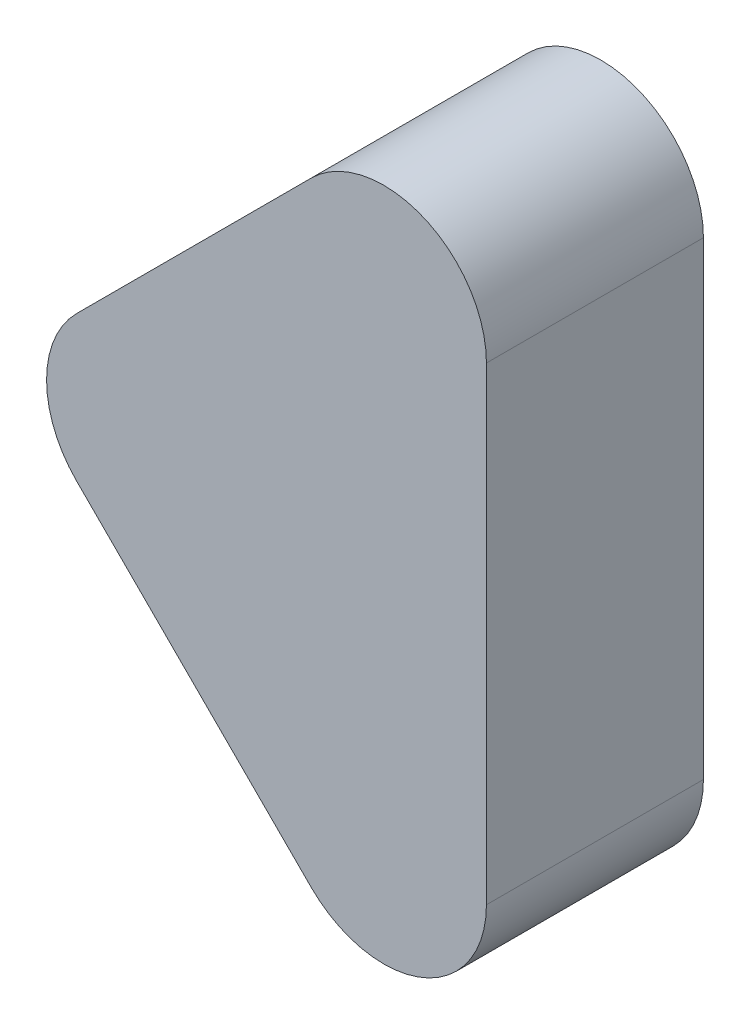
ISO-10303-21;
HEADER;
FILE_DESCRIPTION(('STEP AP214'),'2;1');
FILE_NAME('part.step','',(''),(''),'','','');
FILE_SCHEMA(('AUTOMOTIVE_DESIGN { 1 0 10303 214 1 1 1 1 }'));
ENDSEC;
DATA;
#1=APPLICATION_CONTEXT('core data for automotive mechanical design processes');
#2=APPLICATION_PROTOCOL_DEFINITION('international standard','automotive_design',2000,#1);
#3=PRODUCT_CONTEXT('',#1,'mechanical');
#4=PRODUCT('Part','Part','',(#3));
#5=PRODUCT_RELATED_PRODUCT_CATEGORY('part','',(#4));
#6=PRODUCT_DEFINITION_FORMATION('','',#4);
#7=PRODUCT_DEFINITION_CONTEXT('part definition',#1,'design');
#8=PRODUCT_DEFINITION('design','',#6,#7);
#9=PRODUCT_DEFINITION_SHAPE('','',#8);
#10=(LENGTH_UNIT() NAMED_UNIT(*) SI_UNIT(.MILLI.,.METRE.));
#11=(NAMED_UNIT(*) PLANE_ANGLE_UNIT() SI_UNIT($,.RADIAN.));
#12=(NAMED_UNIT(*) SI_UNIT($,.STERADIAN.) SOLID_ANGLE_UNIT());
#13=UNCERTAINTY_MEASURE_WITH_UNIT(LENGTH_MEASURE(1.E-05),#10,'distance_accuracy_value','');
#14=(GEOMETRIC_REPRESENTATION_CONTEXT(3) GLOBAL_UNCERTAINTY_ASSIGNED_CONTEXT((#13)) GLOBAL_UNIT_ASSIGNED_CONTEXT((#10,
#11,#12)) REPRESENTATION_CONTEXT('',''));
#15=CARTESIAN_POINT('',(0.,0.,0.));
#16=DIRECTION('',(0.,0.,1.));
#17=DIRECTION('',(1.,0.,0.));
#18=AXIS2_PLACEMENT_3D('',#15,#16,#17);
#19=CARTESIAN_POINT('',(8.00000000000002,-11.725,3.7));
#20=DIRECTION('',(0.,0.,-1.));
#21=DIRECTION('',(-1.,0.,0.));
#22=AXIS2_PLACEMENT_3D('',#19,#20,#21);
#23=CYLINDRICAL_SURFACE('',#22,1.75);
#24=CARTESIAN_POINT('',(8.00000000000002,-11.725,0.));
#25=DIRECTION('',(0.,0.,1.));
#26=DIRECTION('',(1.,0.,0.));
#27=AXIS2_PLACEMENT_3D('',#24,#25,#26);
#28=CIRCLE('',#27,1.75);
#29=CARTESIAN_POINT('',(9.75000000000002,-11.725,0.));
#30=VERTEX_POINT('',#29);
#31=CARTESIAN_POINT('',(6.76256313292355,-10.4875631329236,0.));
#32=VERTEX_POINT('',#31);
#33=EDGE_CURVE('E134',#30,#32,#28,.T.);
#34=ORIENTED_EDGE('',*,*,#33,.T.);
#35=DIRECTION('',(0.,0.,-1.));
#36=VECTOR('',#35,1.);
#37=CARTESIAN_POINT('',(6.76256313292355,-10.4875631329236,3.7));
#38=LINE('',#37,#36);
#39=CARTESIAN_POINT('',(6.76256313292355,-10.4875631329236,3.7));
#40=VERTEX_POINT('',#39);
#41=EDGE_CURVE('E12',#40,#32,#38,.T.);
#42=ORIENTED_EDGE('',*,*,#41,.F.);
#43=CARTESIAN_POINT('',(8.00000000000002,-11.725,3.7));
#44=DIRECTION('',(0.,0.,1.));
#45=DIRECTION('',(1.,0.,0.));
#46=AXIS2_PLACEMENT_3D('',#43,#44,#45);
#47=CIRCLE('',#46,1.75);
#48=CARTESIAN_POINT('',(9.75000000000002,-11.725,3.7));
#49=VERTEX_POINT('',#48);
#50=EDGE_CURVE('E148',#49,#40,#47,.T.);
#51=ORIENTED_EDGE('',*,*,#50,.F.);
#52=DIRECTION('',(0.,0.,-1.));
#53=VECTOR('',#52,1.);
#54=CARTESIAN_POINT('',(9.75000000000002,-11.725,3.7));
#55=LINE('',#54,#53);
#56=EDGE_CURVE('E130',#49,#30,#55,.T.);
#57=ORIENTED_EDGE('',*,*,#56,.T.);
#58=EDGE_LOOP('',(#34,#42,#51,#57));
#59=FACE_BOUND('',#58,.T.);
#60=ADVANCED_FACE('F42',(#59),#23,.T.);
#61=CARTESIAN_POINT('',(6.76256313292355,-10.4875631329236,3.7));
#62=DIRECTION('',(0.707106781186548,-0.707106781186547,0.));
#63=DIRECTION('',(0.707106781186547,0.707106781186548,0.));
#64=AXIS2_PLACEMENT_3D('',#61,#62,#63);
#65=PLANE('',#64);
#66=DIRECTION('',(-0.707106781186547,-0.707106781186548,0.));
#67=VECTOR('',#66,1.);
#68=CARTESIAN_POINT('',(6.76256313292355,-10.4875631329236,0.));
#69=LINE('',#68,#67);
#70=CARTESIAN_POINT('',(2.76256313292356,-14.4875631329236,0.));
#71=VERTEX_POINT('',#70);
#72=EDGE_CURVE('E138',#32,#71,#69,.T.);
#73=ORIENTED_EDGE('',*,*,#72,.T.);
#74=DIRECTION('',(0.,0.,-1.));
#75=VECTOR('',#74,1.);
#76=CARTESIAN_POINT('',(2.76256313292356,-14.4875631329236,3.7));
#77=LINE('',#76,#75);
#78=CARTESIAN_POINT('',(2.76256313292356,-14.4875631329236,3.7));
#79=VERTEX_POINT('',#78);
#80=EDGE_CURVE('E51',#79,#71,#77,.T.);
#81=ORIENTED_EDGE('',*,*,#80,.F.);
#82=DIRECTION('',(-0.707106781186547,-0.707106781186548,0.));
#83=VECTOR('',#82,1.);
#84=CARTESIAN_POINT('',(6.76256313292355,-10.4875631329236,3.7));
#85=LINE('',#84,#83);
#86=EDGE_CURVE('E99',#40,#79,#85,.T.);
#87=ORIENTED_EDGE('',*,*,#86,.F.);
#88=ORIENTED_EDGE('',*,*,#41,.T.);
#89=EDGE_LOOP('',(#73,#81,#87,#88));
#90=FACE_BOUND('',#89,.T.);
#91=ADVANCED_FACE('F173',(#90),#65,.F.);
#92=CARTESIAN_POINT('',(4.00000000000001,-15.725,3.7));
#93=DIRECTION('',(0.,0.,-1.));
#94=DIRECTION('',(-1.,0.,0.));
#95=AXIS2_PLACEMENT_3D('',#92,#93,#94);
#96=CYLINDRICAL_SURFACE('',#95,1.75);
#97=CARTESIAN_POINT('',(4.00000000000001,-15.725,0.));
#98=DIRECTION('',(0.,0.,1.));
#99=DIRECTION('',(1.,0.,0.));
#100=AXIS2_PLACEMENT_3D('',#97,#98,#99);
#101=CIRCLE('',#100,1.75);
#102=CARTESIAN_POINT('',(2.76256313292356,-16.9624368670765,0.));
#103=VERTEX_POINT('',#102);
#104=EDGE_CURVE('E141',#71,#103,#101,.T.);
#105=ORIENTED_EDGE('',*,*,#104,.T.);
#106=DIRECTION('',(0.,0.,-1.));
#107=VECTOR('',#106,1.);
#108=CARTESIAN_POINT('',(2.76256313292356,-16.9624368670765,3.7));
#109=LINE('',#108,#107);
#110=CARTESIAN_POINT('',(2.76256313292356,-16.9624368670765,3.7));
#111=VERTEX_POINT('',#110);
#112=EDGE_CURVE('E121',#111,#103,#109,.T.);
#113=ORIENTED_EDGE('',*,*,#112,.F.);
#114=CARTESIAN_POINT('',(4.00000000000001,-15.725,3.7));
#115=DIRECTION('',(0.,0.,1.));
#116=DIRECTION('',(1.,0.,0.));
#117=AXIS2_PLACEMENT_3D('',#114,#115,#116);
#118=CIRCLE('',#117,1.75);
#119=EDGE_CURVE('E112',#79,#111,#118,.T.);
#120=ORIENTED_EDGE('',*,*,#119,.F.);
#121=ORIENTED_EDGE('',*,*,#80,.T.);
#122=EDGE_LOOP('',(#105,#113,#120,#121));
#123=FACE_BOUND('',#122,.T.);
#124=ADVANCED_FACE('F155',(#123),#96,.T.);
#125=CARTESIAN_POINT('',(2.76256313292356,-16.9624368670765,3.7));
#126=DIRECTION('',(0.707106781186548,0.707106781186547,0.));
#127=DIRECTION('',(-0.707106781186547,0.707106781186548,0.));
#128=AXIS2_PLACEMENT_3D('',#125,#126,#127);
#129=PLANE('',#128);
#130=DIRECTION('',(0.707106781186547,-0.707106781186548,0.));
#131=VECTOR('',#130,1.);
#132=CARTESIAN_POINT('',(2.76256313292356,-16.9624368670765,0.));
#133=LINE('',#132,#131);
#134=CARTESIAN_POINT('',(6.76256313292356,-20.9624368670765,0.));
#135=VERTEX_POINT('',#134);
#136=EDGE_CURVE('E120',#103,#135,#133,.T.);
#137=ORIENTED_EDGE('',*,*,#136,.T.);
#138=DIRECTION('',(0.,0.,-1.));
#139=VECTOR('',#138,1.);
#140=CARTESIAN_POINT('',(6.76256313292356,-20.9624368670765,3.7));
#141=LINE('',#140,#139);
#142=CARTESIAN_POINT('',(6.76256313292356,-20.9624368670765,3.7));
#143=VERTEX_POINT('',#142);
#144=EDGE_CURVE('E117',#143,#135,#141,.T.);
#145=ORIENTED_EDGE('',*,*,#144,.F.);
#146=DIRECTION('',(0.707106781186547,-0.707106781186548,0.));
#147=VECTOR('',#146,1.);
#148=CARTESIAN_POINT('',(2.76256313292356,-16.9624368670765,3.7));
#149=LINE('',#148,#147);
#150=EDGE_CURVE('E106',#111,#143,#149,.T.);
#151=ORIENTED_EDGE('',*,*,#150,.F.);
#152=ORIENTED_EDGE('',*,*,#112,.T.);
#153=EDGE_LOOP('',(#137,#145,#151,#152));
#154=FACE_BOUND('',#153,.T.);
#155=ADVANCED_FACE('F118',(#154),#129,.F.);
#156=CARTESIAN_POINT('',(8.00000000000002,-19.725,3.7));
#157=DIRECTION('',(0.,0.,-1.));
#158=DIRECTION('',(-1.,0.,0.));
#159=AXIS2_PLACEMENT_3D('',#156,#157,#158);
#160=CYLINDRICAL_SURFACE('',#159,1.75);
#161=CARTESIAN_POINT('',(8.00000000000002,-19.725,0.));
#162=DIRECTION('',(0.,0.,1.));
#163=DIRECTION('',(1.,0.,0.));
#164=AXIS2_PLACEMENT_3D('',#161,#162,#163);
#165=CIRCLE('',#164,1.75);
#166=CARTESIAN_POINT('',(9.75000000000002,-19.725,0.));
#167=VERTEX_POINT('',#166);
#168=EDGE_CURVE('E85',#135,#167,#165,.T.);
#169=ORIENTED_EDGE('',*,*,#168,.T.);
#170=DIRECTION('',(0.,0.,-1.));
#171=VECTOR('',#170,1.);
#172=CARTESIAN_POINT('',(9.75000000000002,-19.725,3.7));
#173=LINE('',#172,#171);
#174=CARTESIAN_POINT('',(9.75000000000002,-19.725,3.7));
#175=VERTEX_POINT('',#174);
#176=EDGE_CURVE('E122',#175,#167,#173,.T.);
#177=ORIENTED_EDGE('',*,*,#176,.F.);
#178=CARTESIAN_POINT('',(8.00000000000002,-19.725,3.7));
#179=DIRECTION('',(0.,0.,1.));
#180=DIRECTION('',(1.,0.,0.));
#181=AXIS2_PLACEMENT_3D('',#178,#179,#180);
#182=CIRCLE('',#181,1.75);
#183=EDGE_CURVE('E110',#143,#175,#182,.T.);
#184=ORIENTED_EDGE('',*,*,#183,.F.);
#185=ORIENTED_EDGE('',*,*,#144,.T.);
#186=EDGE_LOOP('',(#169,#177,#184,#185));
#187=FACE_BOUND('',#186,.T.);
#188=ADVANCED_FACE('F124',(#187),#160,.T.);
#189=CARTESIAN_POINT('',(9.75000000000002,-19.725,3.7));
#190=DIRECTION('',(-1.,0.,0.));
#191=DIRECTION('',(0.,0.,1.));
#192=AXIS2_PLACEMENT_3D('',#189,#190,#191);
#193=PLANE('',#192);
#194=DIRECTION('',(0.,1.,0.));
#195=VECTOR('',#194,1.);
#196=CARTESIAN_POINT('',(9.75000000000002,-19.725,0.));
#197=LINE('',#196,#195);
#198=EDGE_CURVE('E91',#167,#30,#197,.T.);
#199=ORIENTED_EDGE('',*,*,#198,.T.);
#200=ORIENTED_EDGE('',*,*,#56,.F.);
#201=DIRECTION('',(0.,1.,0.));
#202=VECTOR('',#201,1.);
#203=CARTESIAN_POINT('',(9.75000000000002,-19.725,3.7));
#204=LINE('',#203,#202);
#205=EDGE_CURVE('E59',#175,#49,#204,.T.);
#206=ORIENTED_EDGE('',*,*,#205,.F.);
#207=ORIENTED_EDGE('',*,*,#176,.T.);
#208=EDGE_LOOP('',(#199,#200,#206,#207));
#209=FACE_BOUND('',#208,.T.);
#210=ADVANCED_FACE('F162',(#209),#193,.F.);
#211=CARTESIAN_POINT('',(8.00000000000002,-11.725,3.7));
#212=DIRECTION('',(0.,0.,1.));
#213=DIRECTION('',(1.,0.,0.));
#214=AXIS2_PLACEMENT_3D('',#211,#212,#213);
#215=PLANE('',#214);
#216=ORIENTED_EDGE('',*,*,#50,.T.);
#217=ORIENTED_EDGE('',*,*,#86,.T.);
#218=ORIENTED_EDGE('',*,*,#119,.T.);
#219=ORIENTED_EDGE('',*,*,#150,.T.);
#220=ORIENTED_EDGE('',*,*,#183,.T.);
#221=ORIENTED_EDGE('',*,*,#205,.T.);
#222=EDGE_LOOP('',(#216,#217,#218,#219,#220,#221));
#223=FACE_BOUND('',#222,.T.);
#224=ADVANCED_FACE('F108',(#223),#215,.T.);
#225=CARTESIAN_POINT('',(8.00000000000002,-11.725,0.));
#226=DIRECTION('',(0.,0.,1.));
#227=DIRECTION('',(1.,0.,0.));
#228=AXIS2_PLACEMENT_3D('',#225,#226,#227);
#229=PLANE('',#228);
#230=ORIENTED_EDGE('',*,*,#33,.F.);
#231=ORIENTED_EDGE('',*,*,#198,.F.);
#232=ORIENTED_EDGE('',*,*,#168,.F.);
#233=ORIENTED_EDGE('',*,*,#136,.F.);
#234=ORIENTED_EDGE('',*,*,#104,.F.);
#235=ORIENTED_EDGE('',*,*,#72,.F.);
#236=EDGE_LOOP('',(#230,#231,#232,#233,#234,#235));
#237=FACE_BOUND('',#236,.T.);
#238=ADVANCED_FACE('F158',(#237),#229,.F.);
#239=CLOSED_SHELL('',(#60,#91,#124,#155,#188,#210,#224,#238));
#240=MANIFOLD_SOLID_BREP('B2',#239);
#241=ADVANCED_BREP_SHAPE_REPRESENTATION('',(#18,#240),#14);
#242=SHAPE_DEFINITION_REPRESENTATION(#9,#241);
ENDSEC;
END-ISO-10303-21;
